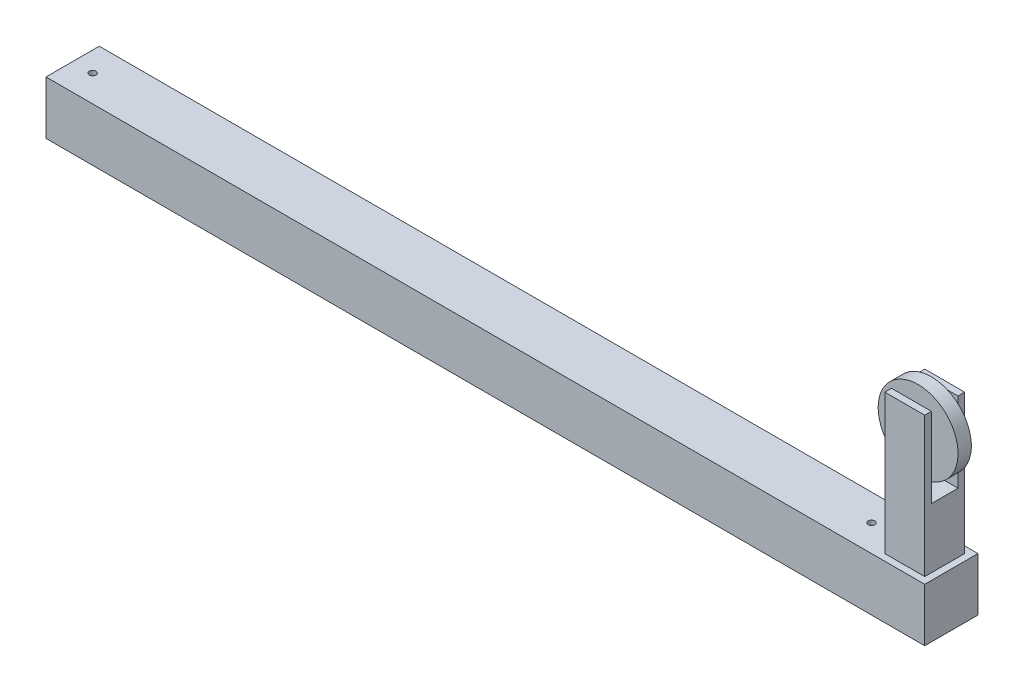
ISO-10303-21;
HEADER;
FILE_DESCRIPTION(('STEP AP214'),'2;1');
FILE_NAME('part.step','',(''),(''),'','','');
FILE_SCHEMA(('AUTOMOTIVE_DESIGN { 1 0 10303 214 1 1 1 1 }'));
ENDSEC;
DATA;
#1=APPLICATION_CONTEXT('core data for automotive mechanical design processes');
#2=APPLICATION_PROTOCOL_DEFINITION('international standard','automotive_design',2000,#1);
#3=PRODUCT_CONTEXT('',#1,'mechanical');
#4=PRODUCT('Part','Part','',(#3));
#5=PRODUCT_RELATED_PRODUCT_CATEGORY('part','',(#4));
#6=PRODUCT_DEFINITION_FORMATION('','',#4);
#7=PRODUCT_DEFINITION_CONTEXT('part definition',#1,'design');
#8=PRODUCT_DEFINITION('design','',#6,#7);
#9=PRODUCT_DEFINITION_SHAPE('','',#8);
#10=(LENGTH_UNIT() NAMED_UNIT(*) SI_UNIT(.MILLI.,.METRE.));
#11=(NAMED_UNIT(*) PLANE_ANGLE_UNIT() SI_UNIT($,.RADIAN.));
#12=(NAMED_UNIT(*) SI_UNIT($,.STERADIAN.) SOLID_ANGLE_UNIT());
#13=UNCERTAINTY_MEASURE_WITH_UNIT(LENGTH_MEASURE(1.E-05),#10,'distance_accuracy_value','');
#14=(GEOMETRIC_REPRESENTATION_CONTEXT(3) GLOBAL_UNCERTAINTY_ASSIGNED_CONTEXT((#13)) GLOBAL_UNIT_ASSIGNED_CONTEXT((#10,
#11,#12)) REPRESENTATION_CONTEXT('',''));
#15=CARTESIAN_POINT('',(0.,0.,0.));
#16=DIRECTION('',(0.,0.,1.));
#17=DIRECTION('',(1.,0.,0.));
#18=AXIS2_PLACEMENT_3D('',#15,#16,#17);
#19=CARTESIAN_POINT('',(1625.6,311.15,-10.5210244842763));
#20=DIRECTION('',(0.,0.,1.));
#21=DIRECTION('',(1.,0.,0.));
#22=AXIS2_PLACEMENT_3D('',#19,#20,#21);
#23=CYLINDRICAL_SURFACE('',#22,12.6999999999999);
#24=CARTESIAN_POINT('',(1625.6,311.15,76.2));
#25=DIRECTION('',(0.,0.,1.));
#26=DIRECTION('',(1.,0.,0.));
#27=AXIS2_PLACEMENT_3D('',#24,#25,#26);
#28=CIRCLE('',#27,12.6999999999999);
#29=CARTESIAN_POINT('',(1638.3,311.15,76.2));
#30=VERTEX_POINT('',#29);
#31=EDGE_CURVE('E276',#30,#30,#28,.F.);
#32=ORIENTED_EDGE('',*,*,#31,.T.);
#33=EDGE_LOOP('',(#32));
#34=FACE_BOUND('',#33,.T.);
#35=CARTESIAN_POINT('',(1625.6,311.15,63.5));
#36=DIRECTION('',(0.,0.,-1.));
#37=DIRECTION('',(-1.,0.,0.));
#38=AXIS2_PLACEMENT_3D('',#35,#36,#37);
#39=CIRCLE('',#38,12.6999999999999);
#40=CARTESIAN_POINT('',(1612.9,311.15,63.5));
#41=VERTEX_POINT('',#40);
#42=EDGE_CURVE('E11',#41,#41,#39,.T.);
#43=ORIENTED_EDGE('',*,*,#42,.F.);
#44=EDGE_LOOP('',(#43));
#45=FACE_BOUND('',#44,.T.);
#46=ADVANCED_FACE('F33',(#34,#45),#23,.T.);
#47=CARTESIAN_POINT('',(0.,215.9,0.));
#48=DIRECTION('',(0.,-1.,0.));
#49=DIRECTION('',(0.,0.,-1.));
#50=AXIS2_PLACEMENT_3D('',#47,#48,#49);
#51=PLANE('',#50);
#52=DIRECTION('',(-1.,0.,0.));
#53=VECTOR('',#52,1.);
#54=CARTESIAN_POINT('',(1663.7,215.9,76.2));
#55=LINE('',#54,#53);
#56=CARTESIAN_POINT('',(1663.7,215.9,76.2));
#57=VERTEX_POINT('',#56);
#58=CARTESIAN_POINT('',(1587.5,215.9,76.2));
#59=VERTEX_POINT('',#58);
#60=EDGE_CURVE('E165',#57,#59,#55,.T.);
#61=ORIENTED_EDGE('',*,*,#60,.F.);
#62=DIRECTION('',(0.,0.,-1.));
#63=VECTOR('',#62,1.);
#64=CARTESIAN_POINT('',(1663.7,215.9,88.9));
#65=LINE('',#64,#63);
#66=CARTESIAN_POINT('',(1663.7,215.9,25.4));
#67=VERTEX_POINT('',#66);
#68=EDGE_CURVE('E170',#57,#67,#65,.T.);
#69=ORIENTED_EDGE('',*,*,#68,.T.);
#70=DIRECTION('',(1.,0.,0.));
#71=VECTOR('',#70,1.);
#72=CARTESIAN_POINT('',(1587.5,215.9,25.4));
#73=LINE('',#72,#71);
#74=CARTESIAN_POINT('',(1587.5,215.9,25.4));
#75=VERTEX_POINT('',#74);
#76=EDGE_CURVE('E53',#75,#67,#73,.T.);
#77=ORIENTED_EDGE('',*,*,#76,.F.);
#78=DIRECTION('',(0.,0.,1.));
#79=VECTOR('',#78,1.);
#80=CARTESIAN_POINT('',(1587.5,215.9,88.9));
#81=LINE('',#80,#79);
#82=EDGE_CURVE('E48',#75,#59,#81,.T.);
#83=ORIENTED_EDGE('',*,*,#82,.T.);
#84=EDGE_LOOP('',(#61,#69,#77,#83));
#85=FACE_BOUND('',#84,.T.);
#86=ADVANCED_FACE('F329',(#85),#51,.F.);
#87=CARTESIAN_POINT('',(0.,101.6,101.6));
#88=DIRECTION('',(0.,1.,0.));
#89=DIRECTION('',(0.,0.,1.));
#90=AXIS2_PLACEMENT_3D('',#87,#88,#89);
#91=PLANE('',#90);
#92=CARTESIAN_POINT('',(38.1,101.6,50.8));
#93=DIRECTION('',(0.,1.,0.));
#94=DIRECTION('',(0.,0.,1.));
#95=AXIS2_PLACEMENT_3D('',#92,#93,#94);
#96=CIRCLE('',#95,6.35);
#97=CARTESIAN_POINT('',(38.1,101.6,57.15));
#98=VERTEX_POINT('',#97);
#99=EDGE_CURVE('E593',#98,#98,#96,.T.);
#100=ORIENTED_EDGE('',*,*,#99,.F.);
#101=EDGE_LOOP('',(#100));
#102=FACE_BOUND('',#101,.T.);
#103=CARTESIAN_POINT('',(1524.,101.6,50.8));
#104=DIRECTION('',(0.,1.,0.));
#105=DIRECTION('',(0.,0.,1.));
#106=AXIS2_PLACEMENT_3D('',#103,#104,#105);
#107=CIRCLE('',#106,6.35000000000016);
#108=CARTESIAN_POINT('',(1524.,101.6,57.1500000000002));
#109=VERTEX_POINT('',#108);
#110=EDGE_CURVE('E594',#109,#109,#107,.T.);
#111=ORIENTED_EDGE('',*,*,#110,.F.);
#112=EDGE_LOOP('',(#111));
#113=FACE_BOUND('',#112,.T.);
#114=DIRECTION('',(1.,0.,0.));
#115=VECTOR('',#114,1.);
#116=CARTESIAN_POINT('',(0.,101.6,0.));
#117=LINE('',#116,#115);
#118=CARTESIAN_POINT('',(0.,101.6,0.));
#119=VERTEX_POINT('',#118);
#120=CARTESIAN_POINT('',(1676.4,101.6,0.));
#121=VERTEX_POINT('',#120);
#122=EDGE_CURVE('E263',#119,#121,#117,.T.);
#123=ORIENTED_EDGE('',*,*,#122,.F.);
#124=DIRECTION('',(0.,0.,-1.));
#125=VECTOR('',#124,1.);
#126=CARTESIAN_POINT('',(0.,101.6,101.6));
#127=LINE('',#126,#125);
#128=CARTESIAN_POINT('',(0.,101.6,101.6));
#129=VERTEX_POINT('',#128);
#130=EDGE_CURVE('E269',#129,#119,#127,.T.);
#131=ORIENTED_EDGE('',*,*,#130,.F.);
#132=DIRECTION('',(1.,0.,0.));
#133=VECTOR('',#132,1.);
#134=CARTESIAN_POINT('',(0.,101.6,101.6));
#135=LINE('',#134,#133);
#136=CARTESIAN_POINT('',(1676.4,101.6,101.6));
#137=VERTEX_POINT('',#136);
#138=EDGE_CURVE('E251',#129,#137,#135,.T.);
#139=ORIENTED_EDGE('',*,*,#138,.T.);
#140=DIRECTION('',(0.,0.,-1.));
#141=VECTOR('',#140,1.);
#142=CARTESIAN_POINT('',(1676.4,101.6,101.6));
#143=LINE('',#142,#141);
#144=EDGE_CURVE('E271',#137,#121,#143,.T.);
#145=ORIENTED_EDGE('',*,*,#144,.T.);
#146=EDGE_LOOP('',(#123,#131,#139,#145));
#147=FACE_BOUND('',#146,.T.);
#148=DIRECTION('',(1.,0.,0.));
#149=VECTOR('',#148,1.);
#150=CARTESIAN_POINT('',(1587.5,101.6,88.9));
#151=LINE('',#150,#149);
#152=CARTESIAN_POINT('',(1587.5,101.6,88.9));
#153=VERTEX_POINT('',#152);
#154=CARTESIAN_POINT('',(1663.7,101.6,88.9));
#155=VERTEX_POINT('',#154);
#156=EDGE_CURVE('E199',#153,#155,#151,.T.);
#157=ORIENTED_EDGE('',*,*,#156,.F.);
#158=DIRECTION('',(0.,0.,1.));
#159=VECTOR('',#158,1.);
#160=CARTESIAN_POINT('',(1587.5,101.6,88.9));
#161=LINE('',#160,#159);
#162=CARTESIAN_POINT('',(1587.5,101.6,12.7));
#163=VERTEX_POINT('',#162);
#164=EDGE_CURVE('E192',#163,#153,#161,.T.);
#165=ORIENTED_EDGE('',*,*,#164,.F.);
#166=DIRECTION('',(-1.,0.,0.));
#167=VECTOR('',#166,1.);
#168=CARTESIAN_POINT('',(1587.5,101.6,12.7));
#169=LINE('',#168,#167);
#170=CARTESIAN_POINT('',(1663.7,101.6,12.7));
#171=VERTEX_POINT('',#170);
#172=EDGE_CURVE('E194',#171,#163,#169,.T.);
#173=ORIENTED_EDGE('',*,*,#172,.F.);
#174=DIRECTION('',(0.,0.,-1.));
#175=VECTOR('',#174,1.);
#176=CARTESIAN_POINT('',(1663.7,101.6,88.9));
#177=LINE('',#176,#175);
#178=EDGE_CURVE('E201',#155,#171,#177,.T.);
#179=ORIENTED_EDGE('',*,*,#178,.F.);
#180=EDGE_LOOP('',(#157,#165,#173,#179));
#181=FACE_BOUND('',#180,.T.);
#182=ADVANCED_FACE('F303',(#102,#113,#147,#181),#91,.T.);
#183=CARTESIAN_POINT('',(0.,0.,101.6));
#184=DIRECTION('',(0.,1.,0.));
#185=DIRECTION('',(0.,0.,1.));
#186=AXIS2_PLACEMENT_3D('',#183,#184,#185);
#187=PLANE('',#186);
#188=DIRECTION('',(1.,0.,0.));
#189=VECTOR('',#188,1.);
#190=CARTESIAN_POINT('',(0.,0.,0.));
#191=LINE('',#190,#189);
#192=CARTESIAN_POINT('',(0.,0.,0.));
#193=VERTEX_POINT('',#192);
#194=CARTESIAN_POINT('',(1676.4,0.,0.));
#195=VERTEX_POINT('',#194);
#196=EDGE_CURVE('E238',#193,#195,#191,.T.);
#197=ORIENTED_EDGE('',*,*,#196,.T.);
#198=DIRECTION('',(0.,0.,-1.));
#199=VECTOR('',#198,1.);
#200=CARTESIAN_POINT('',(1676.4,0.,101.6));
#201=LINE('',#200,#199);
#202=CARTESIAN_POINT('',(1676.4,0.,101.6));
#203=VERTEX_POINT('',#202);
#204=EDGE_CURVE('E273',#203,#195,#201,.T.);
#205=ORIENTED_EDGE('',*,*,#204,.F.);
#206=DIRECTION('',(1.,0.,0.));
#207=VECTOR('',#206,1.);
#208=CARTESIAN_POINT('',(0.,0.,101.6));
#209=LINE('',#208,#207);
#210=CARTESIAN_POINT('',(0.,0.,101.6));
#211=VERTEX_POINT('',#210);
#212=EDGE_CURVE('E245',#211,#203,#209,.T.);
#213=ORIENTED_EDGE('',*,*,#212,.F.);
#214=DIRECTION('',(0.,0.,-1.));
#215=VECTOR('',#214,1.);
#216=CARTESIAN_POINT('',(0.,0.,101.6));
#217=LINE('',#216,#215);
#218=EDGE_CURVE('E257',#211,#193,#217,.T.);
#219=ORIENTED_EDGE('',*,*,#218,.T.);
#220=EDGE_LOOP('',(#197,#205,#213,#219));
#221=FACE_BOUND('',#220,.T.);
#222=ADVANCED_FACE('F35',(#221),#187,.F.);
#223=CARTESIAN_POINT('',(1676.4,0.,101.6));
#224=DIRECTION('',(-1.,0.,0.));
#225=DIRECTION('',(0.,0.,1.));
#226=AXIS2_PLACEMENT_3D('',#223,#224,#225);
#227=PLANE('',#226);
#228=DIRECTION('',(0.,1.,0.));
#229=VECTOR('',#228,1.);
#230=CARTESIAN_POINT('',(1676.4,0.,0.));
#231=LINE('',#230,#229);
#232=EDGE_CURVE('E260',#195,#121,#231,.T.);
#233=ORIENTED_EDGE('',*,*,#232,.T.);
#234=ORIENTED_EDGE('',*,*,#144,.F.);
#235=DIRECTION('',(0.,1.,0.));
#236=VECTOR('',#235,1.);
#237=CARTESIAN_POINT('',(1676.4,0.,101.6));
#238=LINE('',#237,#236);
#239=EDGE_CURVE('E248',#203,#137,#238,.T.);
#240=ORIENTED_EDGE('',*,*,#239,.F.);
#241=ORIENTED_EDGE('',*,*,#204,.T.);
#242=EDGE_LOOP('',(#233,#234,#240,#241));
#243=FACE_BOUND('',#242,.T.);
#244=ADVANCED_FACE('F471',(#243),#227,.F.);
#245=CARTESIAN_POINT('',(0.,0.,101.6));
#246=DIRECTION('',(-1.,0.,0.));
#247=DIRECTION('',(0.,0.,1.));
#248=AXIS2_PLACEMENT_3D('',#245,#246,#247);
#249=PLANE('',#248);
#250=DIRECTION('',(0.,-1.,0.));
#251=VECTOR('',#250,1.);
#252=CARTESIAN_POINT('',(0.,12.7,12.7));
#253=LINE('',#252,#251);
#254=CARTESIAN_POINT('',(0.,88.9,12.7));
#255=VERTEX_POINT('',#254);
#256=CARTESIAN_POINT('',(0.,12.7,12.7));
#257=VERTEX_POINT('',#256);
#258=EDGE_CURVE('E212',#255,#257,#253,.T.);
#259=ORIENTED_EDGE('',*,*,#258,.F.);
#260=DIRECTION('',(0.,0.,-1.));
#261=VECTOR('',#260,1.);
#262=CARTESIAN_POINT('',(0.,88.9,12.7));
#263=LINE('',#262,#261);
#264=CARTESIAN_POINT('',(0.,88.9,88.9));
#265=VERTEX_POINT('',#264);
#266=EDGE_CURVE('E217',#265,#255,#263,.T.);
#267=ORIENTED_EDGE('',*,*,#266,.F.);
#268=DIRECTION('',(0.,1.,0.));
#269=VECTOR('',#268,1.);
#270=CARTESIAN_POINT('',(0.,12.7,88.9));
#271=LINE('',#270,#269);
#272=CARTESIAN_POINT('',(0.,12.7,88.9));
#273=VERTEX_POINT('',#272);
#274=EDGE_CURVE('E231',#273,#265,#271,.T.);
#275=ORIENTED_EDGE('',*,*,#274,.F.);
#276=DIRECTION('',(0.,0.,1.));
#277=VECTOR('',#276,1.);
#278=CARTESIAN_POINT('',(0.,12.7,12.7));
#279=LINE('',#278,#277);
#280=EDGE_CURVE('E228',#257,#273,#279,.T.);
#281=ORIENTED_EDGE('',*,*,#280,.F.);
#282=EDGE_LOOP('',(#259,#267,#275,#281));
#283=FACE_BOUND('',#282,.T.);
#284=DIRECTION('',(0.,1.,0.));
#285=VECTOR('',#284,1.);
#286=CARTESIAN_POINT('',(0.,0.,0.));
#287=LINE('',#286,#285);
#288=EDGE_CURVE('E249',#193,#119,#287,.T.);
#289=ORIENTED_EDGE('',*,*,#288,.F.);
#290=ORIENTED_EDGE('',*,*,#218,.F.);
#291=DIRECTION('',(0.,1.,0.));
#292=VECTOR('',#291,1.);
#293=CARTESIAN_POINT('',(0.,0.,101.6));
#294=LINE('',#293,#292);
#295=EDGE_CURVE('E254',#211,#129,#294,.T.);
#296=ORIENTED_EDGE('',*,*,#295,.T.);
#297=ORIENTED_EDGE('',*,*,#130,.T.);
#298=EDGE_LOOP('',(#289,#290,#296,#297));
#299=FACE_BOUND('',#298,.T.);
#300=ADVANCED_FACE('F465',(#283,#299),#249,.T.);
#301=CARTESIAN_POINT('',(0.,0.,101.6));
#302=DIRECTION('',(0.,0.,1.));
#303=DIRECTION('',(1.,0.,0.));
#304=AXIS2_PLACEMENT_3D('',#301,#302,#303);
#305=PLANE('',#304);
#306=ORIENTED_EDGE('',*,*,#212,.T.);
#307=ORIENTED_EDGE('',*,*,#239,.T.);
#308=ORIENTED_EDGE('',*,*,#138,.F.);
#309=ORIENTED_EDGE('',*,*,#295,.F.);
#310=EDGE_LOOP('',(#306,#307,#308,#309));
#311=FACE_BOUND('',#310,.T.);
#312=ADVANCED_FACE('F470',(#311),#305,.T.);
#313=CARTESIAN_POINT('',(0.,0.,0.));
#314=DIRECTION('',(0.,0.,1.));
#315=DIRECTION('',(1.,0.,0.));
#316=AXIS2_PLACEMENT_3D('',#313,#314,#315);
#317=PLANE('',#316);
#318=ORIENTED_EDGE('',*,*,#196,.F.);
#319=ORIENTED_EDGE('',*,*,#288,.T.);
#320=ORIENTED_EDGE('',*,*,#122,.T.);
#321=ORIENTED_EDGE('',*,*,#232,.F.);
#322=EDGE_LOOP('',(#318,#319,#320,#321));
#323=FACE_BOUND('',#322,.T.);
#324=ADVANCED_FACE('F457',(#323),#317,.F.);
#325=CARTESIAN_POINT('',(127.,12.7,12.7));
#326=DIRECTION('',(0.,0.,-1.));
#327=DIRECTION('',(-1.,0.,0.));
#328=AXIS2_PLACEMENT_3D('',#325,#326,#327);
#329=PLANE('',#328);
#330=ORIENTED_EDGE('',*,*,#258,.T.);
#331=DIRECTION('',(-1.,0.,0.));
#332=VECTOR('',#331,1.);
#333=CARTESIAN_POINT('',(127.,12.7,12.7));
#334=LINE('',#333,#332);
#335=CARTESIAN_POINT('',(127.,12.7,12.7));
#336=VERTEX_POINT('',#335);
#337=EDGE_CURVE('E226',#336,#257,#334,.T.);
#338=ORIENTED_EDGE('',*,*,#337,.F.);
#339=DIRECTION('',(0.,-1.,0.));
#340=VECTOR('',#339,1.);
#341=CARTESIAN_POINT('',(127.,12.7,12.7));
#342=LINE('',#341,#340);
#343=CARTESIAN_POINT('',(127.,88.9,12.7));
#344=VERTEX_POINT('',#343);
#345=EDGE_CURVE('E213',#344,#336,#342,.T.);
#346=ORIENTED_EDGE('',*,*,#345,.F.);
#347=DIRECTION('',(-1.,0.,0.));
#348=VECTOR('',#347,1.);
#349=CARTESIAN_POINT('',(127.,88.9,12.7));
#350=LINE('',#349,#348);
#351=EDGE_CURVE('E236',#344,#255,#350,.T.);
#352=ORIENTED_EDGE('',*,*,#351,.T.);
#353=EDGE_LOOP('',(#330,#338,#346,#352));
#354=FACE_BOUND('',#353,.T.);
#355=ADVANCED_FACE('F452',(#354),#329,.F.);
#356=CARTESIAN_POINT('',(127.,88.9,12.7));
#357=DIRECTION('',(0.,1.,0.));
#358=DIRECTION('',(0.,0.,1.));
#359=AXIS2_PLACEMENT_3D('',#356,#357,#358);
#360=PLANE('',#359);
#361=CARTESIAN_POINT('',(38.1,88.9,50.8));
#362=DIRECTION('',(0.,1.,0.));
#363=DIRECTION('',(0.,0.,1.));
#364=AXIS2_PLACEMENT_3D('',#361,#362,#363);
#365=CIRCLE('',#364,6.35);
#366=CARTESIAN_POINT('',(38.1,88.9,57.15));
#367=VERTEX_POINT('',#366);
#368=EDGE_CURVE('E291',#367,#367,#365,.F.);
#369=ORIENTED_EDGE('',*,*,#368,.F.);
#370=EDGE_LOOP('',(#369));
#371=FACE_BOUND('',#370,.T.);
#372=ORIENTED_EDGE('',*,*,#266,.T.);
#373=ORIENTED_EDGE('',*,*,#351,.F.);
#374=DIRECTION('',(0.,0.,-1.));
#375=VECTOR('',#374,1.);
#376=CARTESIAN_POINT('',(127.,88.9,12.7));
#377=LINE('',#376,#375);
#378=CARTESIAN_POINT('',(127.,88.9,88.9));
#379=VERTEX_POINT('',#378);
#380=EDGE_CURVE('E223',#379,#344,#377,.T.);
#381=ORIENTED_EDGE('',*,*,#380,.F.);
#382=DIRECTION('',(-1.,0.,0.));
#383=VECTOR('',#382,1.);
#384=CARTESIAN_POINT('',(127.,88.9,88.9));
#385=LINE('',#384,#383);
#386=EDGE_CURVE('E239',#379,#265,#385,.T.);
#387=ORIENTED_EDGE('',*,*,#386,.T.);
#388=EDGE_LOOP('',(#372,#373,#381,#387));
#389=FACE_BOUND('',#388,.T.);
#390=ADVANCED_FACE('F444',(#371,#389),#360,.F.);
#391=CARTESIAN_POINT('',(127.,12.7,88.9));
#392=DIRECTION('',(0.,0.,1.));
#393=DIRECTION('',(0.,-1.,0.));
#394=AXIS2_PLACEMENT_3D('',#391,#392,#393);
#395=PLANE('',#394);
#396=ORIENTED_EDGE('',*,*,#274,.T.);
#397=ORIENTED_EDGE('',*,*,#386,.F.);
#398=DIRECTION('',(0.,1.,0.));
#399=VECTOR('',#398,1.);
#400=CARTESIAN_POINT('',(127.,12.7,88.9));
#401=LINE('',#400,#399);
#402=CARTESIAN_POINT('',(127.,12.7,88.9));
#403=VERTEX_POINT('',#402);
#404=EDGE_CURVE('E220',#403,#379,#401,.T.);
#405=ORIENTED_EDGE('',*,*,#404,.F.);
#406=DIRECTION('',(-1.,0.,0.));
#407=VECTOR('',#406,1.);
#408=CARTESIAN_POINT('',(127.,12.7,88.9));
#409=LINE('',#408,#407);
#410=EDGE_CURVE('E241',#403,#273,#409,.T.);
#411=ORIENTED_EDGE('',*,*,#410,.T.);
#412=EDGE_LOOP('',(#396,#397,#405,#411));
#413=FACE_BOUND('',#412,.T.);
#414=ADVANCED_FACE('F434',(#413),#395,.F.);
#415=CARTESIAN_POINT('',(127.,12.7,12.7));
#416=DIRECTION('',(0.,-1.,0.));
#417=DIRECTION('',(0.,0.,-1.));
#418=AXIS2_PLACEMENT_3D('',#415,#416,#417);
#419=PLANE('',#418);
#420=ORIENTED_EDGE('',*,*,#280,.T.);
#421=ORIENTED_EDGE('',*,*,#410,.F.);
#422=DIRECTION('',(0.,0.,1.));
#423=VECTOR('',#422,1.);
#424=CARTESIAN_POINT('',(127.,12.7,12.7));
#425=LINE('',#424,#423);
#426=EDGE_CURVE('E216',#336,#403,#425,.T.);
#427=ORIENTED_EDGE('',*,*,#426,.F.);
#428=ORIENTED_EDGE('',*,*,#337,.T.);
#429=EDGE_LOOP('',(#420,#421,#427,#428));
#430=FACE_BOUND('',#429,.T.);
#431=ADVANCED_FACE('F423',(#430),#419,.F.);
#432=CARTESIAN_POINT('',(127.,0.,0.));
#433=DIRECTION('',(1.,0.,0.));
#434=DIRECTION('',(0.,0.,-1.));
#435=AXIS2_PLACEMENT_3D('',#432,#433,#434);
#436=PLANE('',#435);
#437=ORIENTED_EDGE('',*,*,#345,.T.);
#438=ORIENTED_EDGE('',*,*,#426,.T.);
#439=ORIENTED_EDGE('',*,*,#404,.T.);
#440=ORIENTED_EDGE('',*,*,#380,.T.);
#441=EDGE_LOOP('',(#437,#438,#439,#440));
#442=FACE_BOUND('',#441,.T.);
#443=ADVANCED_FACE('F407',(#442),#436,.F.);
#444=CARTESIAN_POINT('',(1587.5,215.9,88.9));
#445=DIRECTION('',(1.,0.,0.));
#446=DIRECTION('',(0.,0.,-1.));
#447=AXIS2_PLACEMENT_3D('',#444,#445,#446);
#448=PLANE('',#447);
#449=ORIENTED_EDGE('',*,*,#164,.T.);
#450=DIRECTION('',(0.,-1.,0.));
#451=VECTOR('',#450,1.);
#452=CARTESIAN_POINT('',(1587.5,215.9,88.9));
#453=LINE('',#452,#451);
#454=CARTESIAN_POINT('',(1587.5,368.3,88.9));
#455=VERTEX_POINT('',#454);
#456=EDGE_CURVE('E210',#455,#153,#453,.T.);
#457=ORIENTED_EDGE('',*,*,#456,.F.);
#458=DIRECTION('',(0.,0.,1.));
#459=VECTOR('',#458,1.);
#460=CARTESIAN_POINT('',(1587.5,368.3,88.9));
#461=LINE('',#460,#459);
#462=CARTESIAN_POINT('',(1587.5,368.3,76.2));
#463=VERTEX_POINT('',#462);
#464=EDGE_CURVE('E155',#463,#455,#461,.T.);
#465=ORIENTED_EDGE('',*,*,#464,.F.);
#466=DIRECTION('',(0.,-1.,0.));
#467=VECTOR('',#466,1.);
#468=CARTESIAN_POINT('',(1587.5,368.3,76.2));
#469=LINE('',#468,#467);
#470=EDGE_CURVE('E151',#463,#59,#469,.T.);
#471=ORIENTED_EDGE('',*,*,#470,.T.);
#472=ORIENTED_EDGE('',*,*,#82,.F.);
#473=DIRECTION('',(0.,-1.,0.));
#474=VECTOR('',#473,1.);
#475=CARTESIAN_POINT('',(1587.5,368.3,25.4));
#476=LINE('',#475,#474);
#477=CARTESIAN_POINT('',(1587.5,368.3,25.4));
#478=VERTEX_POINT('',#477);
#479=EDGE_CURVE('E189',#478,#75,#476,.T.);
#480=ORIENTED_EDGE('',*,*,#479,.F.);
#481=DIRECTION('',(0.,0.,1.));
#482=VECTOR('',#481,1.);
#483=CARTESIAN_POINT('',(1587.5,368.3,12.7));
#484=LINE('',#483,#482);
#485=CARTESIAN_POINT('',(1587.5,368.3,12.7));
#486=VERTEX_POINT('',#485);
#487=EDGE_CURVE('E172',#486,#478,#484,.T.);
#488=ORIENTED_EDGE('',*,*,#487,.F.);
#489=DIRECTION('',(0.,-1.,0.));
#490=VECTOR('',#489,1.);
#491=CARTESIAN_POINT('',(1587.5,215.9,12.7));
#492=LINE('',#491,#490);
#493=EDGE_CURVE('E196',#486,#163,#492,.T.);
#494=ORIENTED_EDGE('',*,*,#493,.T.);
#495=EDGE_LOOP('',(#449,#457,#465,#471,#472,#480,#488,#494));
#496=FACE_BOUND('',#495,.T.);
#497=ADVANCED_FACE('F309',(#496),#448,.F.);
#498=CARTESIAN_POINT('',(1587.5,215.9,88.9));
#499=DIRECTION('',(0.,0.,-1.));
#500=DIRECTION('',(-1.,0.,0.));
#501=AXIS2_PLACEMENT_3D('',#498,#499,#500);
#502=PLANE('',#501);
#503=ORIENTED_EDGE('',*,*,#156,.T.);
#504=DIRECTION('',(0.,-1.,0.));
#505=VECTOR('',#504,1.);
#506=CARTESIAN_POINT('',(1663.7,215.9,88.9));
#507=LINE('',#506,#505);
#508=CARTESIAN_POINT('',(1663.7,368.3,88.9));
#509=VERTEX_POINT('',#508);
#510=EDGE_CURVE('E208',#509,#155,#507,.T.);
#511=ORIENTED_EDGE('',*,*,#510,.F.);
#512=DIRECTION('',(1.,0.,0.));
#513=VECTOR('',#512,1.);
#514=CARTESIAN_POINT('',(1663.7,368.3,88.9));
#515=LINE('',#514,#513);
#516=EDGE_CURVE('E162',#455,#509,#515,.T.);
#517=ORIENTED_EDGE('',*,*,#516,.F.);
#518=ORIENTED_EDGE('',*,*,#456,.T.);
#519=EDGE_LOOP('',(#503,#511,#517,#518));
#520=FACE_BOUND('',#519,.T.);
#521=ADVANCED_FACE('F298',(#520),#502,.F.);
#522=CARTESIAN_POINT('',(1663.7,215.9,88.9));
#523=DIRECTION('',(-1.,0.,0.));
#524=DIRECTION('',(0.,0.,1.));
#525=AXIS2_PLACEMENT_3D('',#522,#523,#524);
#526=PLANE('',#525);
#527=ORIENTED_EDGE('',*,*,#178,.T.);
#528=DIRECTION('',(0.,-1.,0.));
#529=VECTOR('',#528,1.);
#530=CARTESIAN_POINT('',(1663.7,215.9,12.7));
#531=LINE('',#530,#529);
#532=CARTESIAN_POINT('',(1663.7,368.3,12.7));
#533=VERTEX_POINT('',#532);
#534=EDGE_CURVE('E206',#533,#171,#531,.T.);
#535=ORIENTED_EDGE('',*,*,#534,.F.);
#536=DIRECTION('',(0.,0.,-1.));
#537=VECTOR('',#536,1.);
#538=CARTESIAN_POINT('',(1663.7,368.3,12.7));
#539=LINE('',#538,#537);
#540=CARTESIAN_POINT('',(1663.7,368.3,25.4));
#541=VERTEX_POINT('',#540);
#542=EDGE_CURVE('E181',#541,#533,#539,.T.);
#543=ORIENTED_EDGE('',*,*,#542,.F.);
#544=DIRECTION('',(0.,-1.,0.));
#545=VECTOR('',#544,1.);
#546=CARTESIAN_POINT('',(1663.7,368.3,25.4));
#547=LINE('',#546,#545);
#548=EDGE_CURVE('E186',#541,#67,#547,.T.);
#549=ORIENTED_EDGE('',*,*,#548,.T.);
#550=ORIENTED_EDGE('',*,*,#68,.F.);
#551=DIRECTION('',(0.,-1.,0.));
#552=VECTOR('',#551,1.);
#553=CARTESIAN_POINT('',(1663.7,368.3,76.2));
#554=LINE('',#553,#552);
#555=CARTESIAN_POINT('',(1663.7,368.3,76.2));
#556=VERTEX_POINT('',#555);
#557=EDGE_CURVE('E149',#556,#57,#554,.T.);
#558=ORIENTED_EDGE('',*,*,#557,.F.);
#559=DIRECTION('',(0.,0.,-1.));
#560=VECTOR('',#559,1.);
#561=CARTESIAN_POINT('',(1663.7,368.3,88.9));
#562=LINE('',#561,#560);
#563=EDGE_CURVE('E156',#509,#556,#562,.T.);
#564=ORIENTED_EDGE('',*,*,#563,.F.);
#565=ORIENTED_EDGE('',*,*,#510,.T.);
#566=EDGE_LOOP('',(#527,#535,#543,#549,#550,#558,#564,#565));
#567=FACE_BOUND('',#566,.T.);
#568=ADVANCED_FACE('F168',(#567),#526,.F.);
#569=CARTESIAN_POINT('',(1587.5,215.9,12.7));
#570=DIRECTION('',(0.,0.,1.));
#571=DIRECTION('',(1.,0.,0.));
#572=AXIS2_PLACEMENT_3D('',#569,#570,#571);
#573=PLANE('',#572);
#574=ORIENTED_EDGE('',*,*,#172,.T.);
#575=ORIENTED_EDGE('',*,*,#493,.F.);
#576=DIRECTION('',(-1.,0.,0.));
#577=VECTOR('',#576,1.);
#578=CARTESIAN_POINT('',(1587.5,368.3,12.7));
#579=LINE('',#578,#577);
#580=EDGE_CURVE('E184',#533,#486,#579,.T.);
#581=ORIENTED_EDGE('',*,*,#580,.F.);
#582=ORIENTED_EDGE('',*,*,#534,.T.);
#583=EDGE_LOOP('',(#574,#575,#581,#582));
#584=FACE_BOUND('',#583,.T.);
#585=ADVANCED_FACE('F306',(#584),#573,.F.);
#586=CARTESIAN_POINT('',(1587.5,368.3,25.4));
#587=DIRECTION('',(0.,0.,-1.));
#588=DIRECTION('',(-1.,0.,0.));
#589=AXIS2_PLACEMENT_3D('',#586,#587,#588);
#590=PLANE('',#589);
#591=CARTESIAN_POINT('',(1625.6,311.15,25.4));
#592=DIRECTION('',(0.,0.,-1.));
#593=DIRECTION('',(-1.,0.,0.));
#594=AXIS2_PLACEMENT_3D('',#591,#592,#593);
#595=CIRCLE('',#594,12.6999999999999);
#596=CARTESIAN_POINT('',(1612.9,311.15,25.4));
#597=VERTEX_POINT('',#596);
#598=EDGE_CURVE('E41',#597,#597,#595,.F.);
#599=ORIENTED_EDGE('',*,*,#598,.F.);
#600=EDGE_LOOP('',(#599));
#601=FACE_BOUND('',#600,.T.);
#602=ORIENTED_EDGE('',*,*,#76,.T.);
#603=ORIENTED_EDGE('',*,*,#548,.F.);
#604=DIRECTION('',(1.,0.,0.));
#605=VECTOR('',#604,1.);
#606=CARTESIAN_POINT('',(1587.5,368.3,25.4));
#607=LINE('',#606,#605);
#608=EDGE_CURVE('E179',#478,#541,#607,.T.);
#609=ORIENTED_EDGE('',*,*,#608,.F.);
#610=ORIENTED_EDGE('',*,*,#479,.T.);
#611=EDGE_LOOP('',(#602,#603,#609,#610));
#612=FACE_BOUND('',#611,.T.);
#613=ADVANCED_FACE('F316',(#601,#612),#590,.F.);
#614=CARTESIAN_POINT('',(0.,368.3,0.));
#615=DIRECTION('',(0.,1.,0.));
#616=DIRECTION('',(0.,0.,1.));
#617=AXIS2_PLACEMENT_3D('',#614,#615,#616);
#618=PLANE('',#617);
#619=ORIENTED_EDGE('',*,*,#487,.T.);
#620=ORIENTED_EDGE('',*,*,#608,.T.);
#621=ORIENTED_EDGE('',*,*,#542,.T.);
#622=ORIENTED_EDGE('',*,*,#580,.T.);
#623=EDGE_LOOP('',(#619,#620,#621,#622));
#624=FACE_BOUND('',#623,.T.);
#625=ADVANCED_FACE('F312',(#624),#618,.T.);
#626=CARTESIAN_POINT('',(1663.7,368.3,76.2));
#627=DIRECTION('',(0.,0.,1.));
#628=DIRECTION('',(1.,0.,0.));
#629=AXIS2_PLACEMENT_3D('',#626,#627,#628);
#630=PLANE('',#629);
#631=ORIENTED_EDGE('',*,*,#31,.F.);
#632=EDGE_LOOP('',(#631));
#633=FACE_BOUND('',#632,.T.);
#634=ORIENTED_EDGE('',*,*,#60,.T.);
#635=ORIENTED_EDGE('',*,*,#470,.F.);
#636=DIRECTION('',(-1.,0.,0.));
#637=VECTOR('',#636,1.);
#638=CARTESIAN_POINT('',(1663.7,368.3,76.2));
#639=LINE('',#638,#637);
#640=EDGE_CURVE('E145',#556,#463,#639,.T.);
#641=ORIENTED_EDGE('',*,*,#640,.F.);
#642=ORIENTED_EDGE('',*,*,#557,.T.);
#643=EDGE_LOOP('',(#634,#635,#641,#642));
#644=FACE_BOUND('',#643,.T.);
#645=ADVANCED_FACE('F147',(#633,#644),#630,.F.);
#646=CARTESIAN_POINT('',(0.,368.3,0.));
#647=DIRECTION('',(0.,1.,0.));
#648=DIRECTION('',(0.,0.,1.));
#649=AXIS2_PLACEMENT_3D('',#646,#647,#648);
#650=PLANE('',#649);
#651=ORIENTED_EDGE('',*,*,#563,.T.);
#652=ORIENTED_EDGE('',*,*,#640,.T.);
#653=ORIENTED_EDGE('',*,*,#464,.T.);
#654=ORIENTED_EDGE('',*,*,#516,.T.);
#655=EDGE_LOOP('',(#651,#652,#653,#654));
#656=FACE_BOUND('',#655,.T.);
#657=ADVANCED_FACE('F160',(#656),#650,.T.);
#658=CARTESIAN_POINT('',(1625.6,311.15,38.1));
#659=DIRECTION('',(0.,0.,-1.));
#660=DIRECTION('',(-1.,0.,0.));
#661=AXIS2_PLACEMENT_3D('',#658,#659,#660);
#662=CIRCLE('',#661,12.6999999999999);
#663=CARTESIAN_POINT('',(1612.9,311.15,38.1));
#664=VERTEX_POINT('',#663);
#665=EDGE_CURVE('E280',#664,#664,#662,.T.);
#666=ORIENTED_EDGE('',*,*,#665,.T.);
#667=EDGE_LOOP('',(#666));
#668=FACE_BOUND('',#667,.T.);
#669=ORIENTED_EDGE('',*,*,#598,.T.);
#670=EDGE_LOOP('',(#669));
#671=FACE_BOUND('',#670,.T.);
#672=ADVANCED_FACE('F332',(#668,#671),#23,.T.);
#673=CARTESIAN_POINT('',(1625.6,311.15,63.5));
#674=DIRECTION('',(0.,0.,-1.));
#675=DIRECTION('',(-1.,0.,0.));
#676=AXIS2_PLACEMENT_3D('',#673,#674,#675);
#677=CYLINDRICAL_SURFACE('',#676,76.2);
#678=CARTESIAN_POINT('',(1625.6,311.15,63.5));
#679=DIRECTION('',(0.,0.,-1.));
#680=DIRECTION('',(-1.,0.,0.));
#681=AXIS2_PLACEMENT_3D('',#678,#679,#680);
#682=CIRCLE('',#681,76.2);
#683=CARTESIAN_POINT('',(1549.4,311.15,63.5));
#684=VERTEX_POINT('',#683);
#685=EDGE_CURVE('E282',#684,#684,#682,.T.);
#686=ORIENTED_EDGE('',*,*,#685,.T.);
#687=EDGE_LOOP('',(#686));
#688=FACE_BOUND('',#687,.T.);
#689=CARTESIAN_POINT('',(1625.6,311.15,38.1));
#690=DIRECTION('',(0.,0.,-1.));
#691=DIRECTION('',(-1.,0.,0.));
#692=AXIS2_PLACEMENT_3D('',#689,#690,#691);
#693=CIRCLE('',#692,76.2);
#694=CARTESIAN_POINT('',(1549.4,311.15,38.1));
#695=VERTEX_POINT('',#694);
#696=EDGE_CURVE('E286',#695,#695,#693,.T.);
#697=ORIENTED_EDGE('',*,*,#696,.F.);
#698=EDGE_LOOP('',(#697));
#699=FACE_BOUND('',#698,.T.);
#700=ADVANCED_FACE('F340',(#688,#699),#677,.T.);
#701=CARTESIAN_POINT('',(1625.6,311.15,63.5));
#702=DIRECTION('',(0.,0.,-1.));
#703=DIRECTION('',(-1.,0.,0.));
#704=AXIS2_PLACEMENT_3D('',#701,#702,#703);
#705=PLANE('',#704);
#706=ORIENTED_EDGE('',*,*,#42,.T.);
#707=EDGE_LOOP('',(#706));
#708=FACE_BOUND('',#707,.T.);
#709=ORIENTED_EDGE('',*,*,#685,.F.);
#710=EDGE_LOOP('',(#709));
#711=FACE_BOUND('',#710,.T.);
#712=ADVANCED_FACE('F345',(#708,#711),#705,.F.);
#713=CARTESIAN_POINT('',(1625.6,311.15,38.1));
#714=DIRECTION('',(0.,0.,-1.));
#715=DIRECTION('',(-1.,0.,0.));
#716=AXIS2_PLACEMENT_3D('',#713,#714,#715);
#717=PLANE('',#716);
#718=ORIENTED_EDGE('',*,*,#665,.F.);
#719=EDGE_LOOP('',(#718));
#720=FACE_BOUND('',#719,.T.);
#721=ORIENTED_EDGE('',*,*,#696,.T.);
#722=EDGE_LOOP('',(#721));
#723=FACE_BOUND('',#722,.T.);
#724=ADVANCED_FACE('F518',(#720,#723),#717,.T.);
#725=CARTESIAN_POINT('',(38.1,70.9394877578614,50.8));
#726=DIRECTION('',(0.,1.,0.));
#727=DIRECTION('',(0.,0.,1.));
#728=AXIS2_PLACEMENT_3D('',#725,#726,#727);
#729=CYLINDRICAL_SURFACE('',#728,6.35);
#730=ORIENTED_EDGE('',*,*,#368,.T.);
#731=EDGE_LOOP('',(#730));
#732=FACE_BOUND('',#731,.T.);
#733=ORIENTED_EDGE('',*,*,#99,.T.);
#734=EDGE_LOOP('',(#733));
#735=FACE_BOUND('',#734,.T.);
#736=ADVANCED_FACE('F530',(#732,#735),#729,.F.);
#737=CARTESIAN_POINT('',(1524.,70.9394877578614,50.8));
#738=DIRECTION('',(0.,1.,0.));
#739=DIRECTION('',(0.,0.,1.));
#740=AXIS2_PLACEMENT_3D('',#737,#738,#739);
#741=CYLINDRICAL_SURFACE('',#740,6.35000000000016);
#742=CARTESIAN_POINT('',(1524.,88.9,50.8));
#743=DIRECTION('',(0.,1.,0.));
#744=DIRECTION('',(0.,0.,1.));
#745=AXIS2_PLACEMENT_3D('',#742,#743,#744);
#746=CIRCLE('',#745,6.35000000000016);
#747=CARTESIAN_POINT('',(1524.,88.9,57.1500000000002));
#748=VERTEX_POINT('',#747);
#749=EDGE_CURVE('E592',#748,#748,#746,.F.);
#750=ORIENTED_EDGE('',*,*,#749,.T.);
#751=EDGE_LOOP('',(#750));
#752=FACE_BOUND('',#751,.T.);
#753=ORIENTED_EDGE('',*,*,#110,.T.);
#754=EDGE_LOOP('',(#753));
#755=FACE_BOUND('',#754,.T.);
#756=ADVANCED_FACE('F535',(#752,#755),#741,.F.);
#757=CARTESIAN_POINT('',(127.,88.9,12.7));
#758=DIRECTION('',(0.,1.,0.));
#759=DIRECTION('',(0.,0.,1.));
#760=AXIS2_PLACEMENT_3D('',#757,#758,#759);
#761=PLANE('',#760);
#762=ORIENTED_EDGE('',*,*,#749,.F.);
#763=EDGE_LOOP('',(#762));
#764=FACE_BOUND('',#763,.T.);
#765=ADVANCED_FACE('F545',(#764),#761,.T.);
#766=CLOSED_SHELL('',(#46,#86,#182,#222,#244,#300,#312,#324,#355,#390,#414,#431,#443,#497,#521,
#568,#585,#613,#625,#645,#657,#672,#700,#712,#724,#736,#756,#765));
#767=MANIFOLD_SOLID_BREP('B2',#766);
#768=ADVANCED_BREP_SHAPE_REPRESENTATION('',(#18,#767),#14);
#769=SHAPE_DEFINITION_REPRESENTATION(#9,#768);
ENDSEC;
END-ISO-10303-21;
